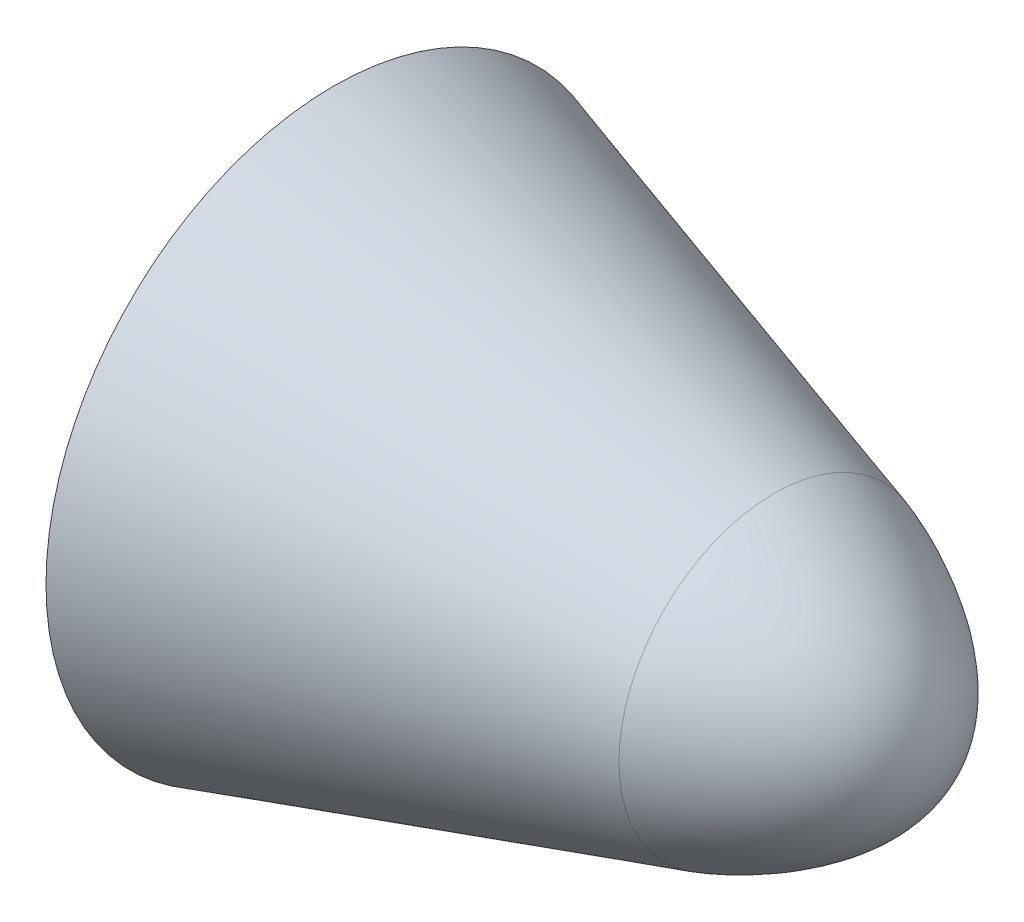
ISO-10303-21;
HEADER;
FILE_DESCRIPTION(('STEP AP214'),'2;1');
FILE_NAME('part.step','',(''),(''),'','','');
FILE_SCHEMA(('AUTOMOTIVE_DESIGN { 1 0 10303 214 1 1 1 1 }'));
ENDSEC;
DATA;
#1=APPLICATION_CONTEXT('core data for automotive mechanical design processes');
#2=APPLICATION_PROTOCOL_DEFINITION('international standard','automotive_design',2000,#1);
#3=PRODUCT_CONTEXT('',#1,'mechanical');
#4=PRODUCT('Part','Part','',(#3));
#5=PRODUCT_RELATED_PRODUCT_CATEGORY('part','',(#4));
#6=PRODUCT_DEFINITION_FORMATION('','',#4);
#7=PRODUCT_DEFINITION_CONTEXT('part definition',#1,'design');
#8=PRODUCT_DEFINITION('design','',#6,#7);
#9=PRODUCT_DEFINITION_SHAPE('','',#8);
#10=(LENGTH_UNIT() NAMED_UNIT(*) SI_UNIT(.MILLI.,.METRE.));
#11=(NAMED_UNIT(*) PLANE_ANGLE_UNIT() SI_UNIT($,.RADIAN.));
#12=(NAMED_UNIT(*) SI_UNIT($,.STERADIAN.) SOLID_ANGLE_UNIT());
#13=UNCERTAINTY_MEASURE_WITH_UNIT(LENGTH_MEASURE(1.E-05),#10,'distance_accuracy_value','');
#14=(GEOMETRIC_REPRESENTATION_CONTEXT(3) GLOBAL_UNCERTAINTY_ASSIGNED_CONTEXT((#13)) GLOBAL_UNIT_ASSIGNED_CONTEXT((#10,
#11,#12)) REPRESENTATION_CONTEXT('',''));
#15=CARTESIAN_POINT('',(0.,0.,0.));
#16=DIRECTION('',(0.,0.,1.));
#17=DIRECTION('',(1.,0.,0.));
#18=AXIS2_PLACEMENT_3D('',#15,#16,#17);
#19=CARTESIAN_POINT('',(3563.27305583667,697.146676222264,0.));
#20=DIRECTION('',(1.,0.,0.));
#21=DIRECTION('',(0.,0.,-1.));
#22=AXIS2_PLACEMENT_3D('',#19,#20,#21);
#23=PLANE('',#22);
#24=CARTESIAN_POINT('',(3563.27305583667,443.494261025389,0.));
#25=DIRECTION('',(-1.,0.,0.));
#26=DIRECTION('',(0.,0.,1.));
#27=AXIS2_PLACEMENT_3D('',#24,#25,#26);
#28=CIRCLE('',#27,253.652415196875);
#29=CARTESIAN_POINT('',(3563.27305583667,443.494261025389,253.652415196875));
#30=VERTEX_POINT('',#29);
#31=EDGE_CURVE('E11',#30,#30,#28,.T.);
#32=ORIENTED_EDGE('',*,*,#31,.T.);
#33=EDGE_LOOP('',(#32));
#34=FACE_BOUND('',#33,.T.);
#35=ADVANCED_FACE('F41',(#34),#23,.F.);
#36=CARTESIAN_POINT('',(3951.75331642884,443.494261025389,0.));
#37=DIRECTION('',(-1.,0.,0.));
#38=DIRECTION('',(0.,0.,1.));
#39=AXIS2_PLACEMENT_3D('',#36,#37,#38);
#40=CONICAL_SURFACE('',#39,136.782409050413,0.292226324942503);
#41=ORIENTED_EDGE('',*,*,#31,.F.);
#42=EDGE_LOOP('',(#41));
#43=FACE_BOUND('',#42,.T.);
#44=CARTESIAN_POINT('',(3951.75331642884,443.494261025389,0.));
#45=DIRECTION('',(-1.,0.,0.));
#46=DIRECTION('',(0.,0.,1.));
#47=AXIS2_PLACEMENT_3D('',#44,#45,#46);
#48=CIRCLE('',#47,136.782409050413);
#49=CARTESIAN_POINT('',(3951.75331642884,443.494261025389,136.782409050413));
#50=VERTEX_POINT('',#49);
#51=EDGE_CURVE('E48',#50,#50,#48,.T.);
#52=ORIENTED_EDGE('',*,*,#51,.T.);
#53=EDGE_LOOP('',(#52));
#54=FACE_BOUND('',#53,.T.);
#55=ADVANCED_FACE('F53',(#43,#54),#40,.T.);
#56=CARTESIAN_POINT('',(4092.30615996181,443.494261025389,0.));
#57=CARTESIAN_POINT('',(4092.30615996181,523.659484663848,0.));
#58=CARTESIAN_POINT('',(3981.11011469387,571.445000769245,0.));
#59=CARTESIAN_POINT('',(3951.75331642884,580.276670075802,0.));
#60=B_SPLINE_CURVE_WITH_KNOTS('',3,(#56,#57,#58,#59),.UNSPECIFIED.,.F.,.F.,(4,4),(0.,1.),.UNSPECIFIED.);
#61=CARTESIAN_POINT('',(3563.27305583667,443.494261025389,0.));
#62=DIRECTION('',(-1.,0.,0.));
#63=AXIS1_PLACEMENT('',#61,#62);
#64=SURFACE_OF_REVOLUTION('',#60,#63);
#65=ORIENTED_EDGE('',*,*,#51,.F.);
#66=EDGE_LOOP('',(#65));
#67=FACE_BOUND('',#66,.T.);
#68=CARTESIAN_POINT('',(4092.30615996181,443.494261025389,0.));
#69=VERTEX_POINT('',#68);
#70=VERTEX_LOOP('',#69);
#71=FACE_BOUND('',#70,.T.);
#72=ADVANCED_FACE('F51',(#67,#71),#64,.T.);
#73=CLOSED_SHELL('',(#35,#55,#72));
#74=MANIFOLD_SOLID_BREP('B2',#73);
#75=ADVANCED_BREP_SHAPE_REPRESENTATION('',(#18,#74),#14);
#76=SHAPE_DEFINITION_REPRESENTATION(#9,#75);
ENDSEC;
END-ISO-10303-21;
